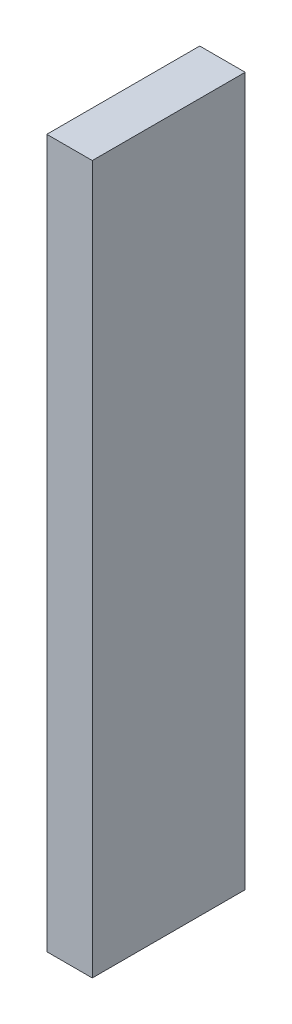
ISO-10303-21;
HEADER;
FILE_DESCRIPTION(('STEP AP214'),'2;1');
FILE_NAME('part.step','',(''),(''),'','','');
FILE_SCHEMA(('AUTOMOTIVE_DESIGN { 1 0 10303 214 1 1 1 1 }'));
ENDSEC;
DATA;
#1=APPLICATION_CONTEXT('core data for automotive mechanical design processes');
#2=APPLICATION_PROTOCOL_DEFINITION('international standard','automotive_design',2000,#1);
#3=PRODUCT_CONTEXT('',#1,'mechanical');
#4=PRODUCT('Part','Part','',(#3));
#5=PRODUCT_RELATED_PRODUCT_CATEGORY('part','',(#4));
#6=PRODUCT_DEFINITION_FORMATION('','',#4);
#7=PRODUCT_DEFINITION_CONTEXT('part definition',#1,'design');
#8=PRODUCT_DEFINITION('design','',#6,#7);
#9=PRODUCT_DEFINITION_SHAPE('','',#8);
#10=(LENGTH_UNIT() NAMED_UNIT(*) SI_UNIT(.MILLI.,.METRE.));
#11=(NAMED_UNIT(*) PLANE_ANGLE_UNIT() SI_UNIT($,.RADIAN.));
#12=(NAMED_UNIT(*) SI_UNIT($,.STERADIAN.) SOLID_ANGLE_UNIT());
#13=UNCERTAINTY_MEASURE_WITH_UNIT(LENGTH_MEASURE(1.E-05),#10,'distance_accuracy_value','');
#14=(GEOMETRIC_REPRESENTATION_CONTEXT(3) GLOBAL_UNCERTAINTY_ASSIGNED_CONTEXT((#13)) GLOBAL_UNIT_ASSIGNED_CONTEXT((#10,
#11,#12)) REPRESENTATION_CONTEXT('',''));
#15=CARTESIAN_POINT('',(0.,0.,0.));
#16=DIRECTION('',(0.,0.,1.));
#17=DIRECTION('',(1.,0.,0.));
#18=AXIS2_PLACEMENT_3D('',#15,#16,#17);
#19=CARTESIAN_POINT('',(130.275545246328,22.4180708263693,66.0720244776067));
#20=DIRECTION('',(-1.69244514382854E-09,0.,1.));
#21=DIRECTION('',(1.,0.,1.69244514382854E-09));
#22=AXIS2_PLACEMENT_3D('',#19,#20,#21);
#23=PLANE('',#22);
#24=DIRECTION('',(0.,-1.,0.));
#25=VECTOR('',#24,1.);
#26=CARTESIAN_POINT('',(131.258630343341,22.4180708263693,66.0720244792706));
#27=LINE('',#26,#25);
#28=CARTESIAN_POINT('',(131.258630343341,22.4180708263693,66.0720244792706));
#29=VERTEX_POINT('',#28);
#30=CARTESIAN_POINT('',(131.258630343341,7.11212965552236,66.0720244792705));
#31=VERTEX_POINT('',#30);
#32=EDGE_CURVE('E79',#29,#31,#27,.T.);
#33=ORIENTED_EDGE('',*,*,#32,.F.);
#34=DIRECTION('',(1.,0.,1.69244514382854E-09));
#35=VECTOR('',#34,1.);
#36=CARTESIAN_POINT('',(130.275545246328,22.4180708263693,66.0720244776067));
#37=LINE('',#36,#35);
#38=CARTESIAN_POINT('',(130.275545246328,22.4180708263693,66.0720244776067));
#39=VERTEX_POINT('',#38);
#40=EDGE_CURVE('E32',#39,#29,#37,.T.);
#41=ORIENTED_EDGE('',*,*,#40,.F.);
#42=DIRECTION('',(0.,-1.,0.));
#43=VECTOR('',#42,1.);
#44=CARTESIAN_POINT('',(130.275545246328,22.4180708263693,66.0720244776067));
#45=LINE('',#44,#43);
#46=CARTESIAN_POINT('',(130.275545246328,7.11212965552236,66.0720244776067));
#47=VERTEX_POINT('',#46);
#48=EDGE_CURVE('E71',#39,#47,#45,.T.);
#49=ORIENTED_EDGE('',*,*,#48,.T.);
#50=DIRECTION('',(1.,0.,1.69244514382854E-09));
#51=VECTOR('',#50,1.);
#52=CARTESIAN_POINT('',(130.275545246328,7.11212965552236,66.0720244776067));
#53=LINE('',#52,#51);
#54=EDGE_CURVE('E10',#47,#31,#53,.T.);
#55=ORIENTED_EDGE('',*,*,#54,.T.);
#56=EDGE_LOOP('',(#33,#41,#49,#55));
#57=FACE_BOUND('',#56,.T.);
#58=ADVANCED_FACE('F16',(#57),#23,.T.);
#59=CARTESIAN_POINT('',(130.275545246328,7.11212965552236,66.0720244776067));
#60=DIRECTION('',(0.,-1.,0.));
#61=DIRECTION('',(0.,0.,-1.));
#62=AXIS2_PLACEMENT_3D('',#59,#60,#61);
#63=PLANE('',#62);
#64=DIRECTION('',(1.69244514382854E-09,0.,-1.));
#65=VECTOR('',#64,1.);
#66=CARTESIAN_POINT('',(131.258630343341,7.11212965552236,66.0720244792705));
#67=LINE('',#66,#65);
#68=CARTESIAN_POINT('',(131.258630348936,7.11212965552235,62.7660833084218));
#69=VERTEX_POINT('',#68);
#70=EDGE_CURVE('E82',#31,#69,#67,.T.);
#71=ORIENTED_EDGE('',*,*,#70,.F.);
#72=ORIENTED_EDGE('',*,*,#54,.F.);
#73=DIRECTION('',(1.69244514382854E-09,0.,-1.));
#74=VECTOR('',#73,1.);
#75=CARTESIAN_POINT('',(130.275545246328,7.11212965552236,66.0720244776067));
#76=LINE('',#75,#74);
#77=CARTESIAN_POINT('',(130.275545251923,7.11212965552235,62.766083306758));
#78=VERTEX_POINT('',#77);
#79=EDGE_CURVE('E67',#47,#78,#76,.T.);
#80=ORIENTED_EDGE('',*,*,#79,.T.);
#81=DIRECTION('',(1.,0.,1.69244514382854E-09));
#82=VECTOR('',#81,1.);
#83=CARTESIAN_POINT('',(130.275545251923,7.11212965552235,62.766083306758));
#84=LINE('',#83,#82);
#85=EDGE_CURVE('E24',#78,#69,#84,.T.);
#86=ORIENTED_EDGE('',*,*,#85,.T.);
#87=EDGE_LOOP('',(#71,#72,#80,#86));
#88=FACE_BOUND('',#87,.T.);
#89=ADVANCED_FACE('F68',(#88),#63,.T.);
#90=CARTESIAN_POINT('',(130.275545251923,7.11212965552235,62.766083306758));
#91=DIRECTION('',(1.69244514382854E-09,0.,-1.));
#92=DIRECTION('',(-1.,0.,-1.69244514382854E-09));
#93=AXIS2_PLACEMENT_3D('',#90,#91,#92);
#94=PLANE('',#93);
#95=DIRECTION('',(0.,1.,0.));
#96=VECTOR('',#95,1.);
#97=CARTESIAN_POINT('',(131.258630348936,7.11212965552235,62.7660833084218));
#98=LINE('',#97,#96);
#99=CARTESIAN_POINT('',(131.258630348936,22.418070826371,62.7660832999613));
#100=VERTEX_POINT('',#99);
#101=EDGE_CURVE('E65',#69,#100,#98,.T.);
#102=ORIENTED_EDGE('',*,*,#101,.F.);
#103=ORIENTED_EDGE('',*,*,#85,.F.);
#104=DIRECTION('',(0.,1.,0.));
#105=VECTOR('',#104,1.);
#106=CARTESIAN_POINT('',(130.275545251923,7.11212965552235,62.766083306758));
#107=LINE('',#106,#105);
#108=CARTESIAN_POINT('',(130.275545251923,22.418070826371,62.7660832982974));
#109=VERTEX_POINT('',#108);
#110=EDGE_CURVE('E62',#78,#109,#107,.T.);
#111=ORIENTED_EDGE('',*,*,#110,.T.);
#112=DIRECTION('',(1.,0.,1.69244514382854E-09));
#113=VECTOR('',#112,1.);
#114=CARTESIAN_POINT('',(130.275545251923,22.418070826371,62.7660832982974));
#115=LINE('',#114,#113);
#116=EDGE_CURVE('E48',#109,#100,#115,.T.);
#117=ORIENTED_EDGE('',*,*,#116,.T.);
#118=EDGE_LOOP('',(#102,#103,#111,#117));
#119=FACE_BOUND('',#118,.T.);
#120=ADVANCED_FACE('F60',(#119),#94,.T.);
#121=CARTESIAN_POINT('',(130.275545251923,22.418070826371,62.7660832982974));
#122=DIRECTION('',(0.,1.,0.));
#123=DIRECTION('',(-1.,0.,0.));
#124=AXIS2_PLACEMENT_3D('',#121,#122,#123);
#125=PLANE('',#124);
#126=DIRECTION('',(-1.69244514382854E-09,0.,1.));
#127=VECTOR('',#126,1.);
#128=CARTESIAN_POINT('',(131.258630348936,22.418070826371,62.7660832999613));
#129=LINE('',#128,#127);
#130=EDGE_CURVE('E85',#100,#29,#129,.T.);
#131=ORIENTED_EDGE('',*,*,#130,.F.);
#132=ORIENTED_EDGE('',*,*,#116,.F.);
#133=DIRECTION('',(-1.69244514382854E-09,0.,1.));
#134=VECTOR('',#133,1.);
#135=CARTESIAN_POINT('',(130.275545251923,22.418070826371,62.7660832982974));
#136=LINE('',#135,#134);
#137=EDGE_CURVE('E74',#109,#39,#136,.T.);
#138=ORIENTED_EDGE('',*,*,#137,.T.);
#139=ORIENTED_EDGE('',*,*,#40,.T.);
#140=EDGE_LOOP('',(#131,#132,#138,#139));
#141=FACE_BOUND('',#140,.T.);
#142=ADVANCED_FACE('F96',(#141),#125,.T.);
#143=CARTESIAN_POINT('',(130.275545201028,17.2651002409467,92.8378607087388));
#144=DIRECTION('',(1.,0.,1.69244514382854E-09));
#145=DIRECTION('',(0.,1.,0.));
#146=AXIS2_PLACEMENT_3D('',#143,#144,#145);
#147=PLANE('',#146);
#148=ORIENTED_EDGE('',*,*,#48,.F.);
#149=ORIENTED_EDGE('',*,*,#137,.F.);
#150=ORIENTED_EDGE('',*,*,#110,.F.);
#151=ORIENTED_EDGE('',*,*,#79,.F.);
#152=EDGE_LOOP('',(#148,#149,#150,#151));
#153=FACE_BOUND('',#152,.T.);
#154=ADVANCED_FACE('F73',(#153),#147,.F.);
#155=CARTESIAN_POINT('',(131.258630298041,17.2651002409467,92.8378607104026));
#156=DIRECTION('',(1.,0.,1.69244514382854E-09));
#157=DIRECTION('',(0.,1.,0.));
#158=AXIS2_PLACEMENT_3D('',#155,#156,#157);
#159=PLANE('',#158);
#160=ORIENTED_EDGE('',*,*,#32,.T.);
#161=ORIENTED_EDGE('',*,*,#70,.T.);
#162=ORIENTED_EDGE('',*,*,#101,.T.);
#163=ORIENTED_EDGE('',*,*,#130,.T.);
#164=EDGE_LOOP('',(#160,#161,#162,#163));
#165=FACE_BOUND('',#164,.T.);
#166=ADVANCED_FACE('F89',(#165),#159,.T.);
#167=CLOSED_SHELL('',(#58,#89,#120,#142,#154,#166));
#168=MANIFOLD_SOLID_BREP('B1',#167);
#169=ADVANCED_BREP_SHAPE_REPRESENTATION('',(#18,#168),#14);
#170=SHAPE_DEFINITION_REPRESENTATION(#9,#169);
ENDSEC;
END-ISO-10303-21;
